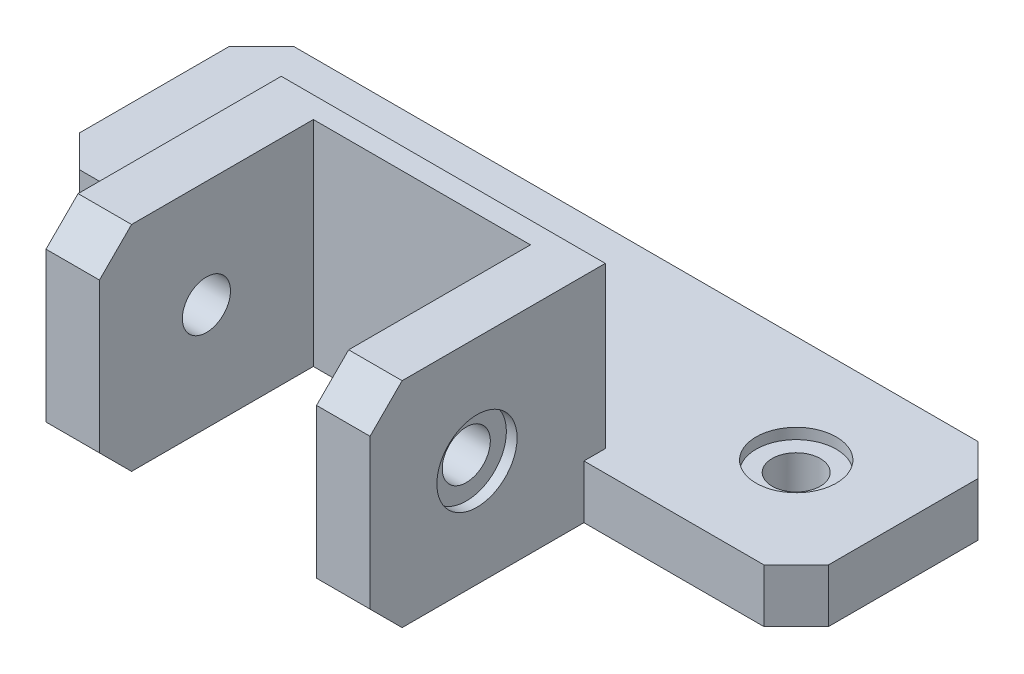
ISO-10303-21;
HEADER;
FILE_DESCRIPTION(('STEP AP214'),'2;1');
FILE_NAME('part.step','',(''),(''),'','','');
FILE_SCHEMA(('AUTOMOTIVE_DESIGN { 1 0 10303 214 1 1 1 1 }'));
ENDSEC;
DATA;
#1=APPLICATION_CONTEXT('core data for automotive mechanical design processes');
#2=APPLICATION_PROTOCOL_DEFINITION('international standard','automotive_design',2000,#1);
#3=PRODUCT_CONTEXT('',#1,'mechanical');
#4=PRODUCT('Part','Part','',(#3));
#5=PRODUCT_RELATED_PRODUCT_CATEGORY('part','',(#4));
#6=PRODUCT_DEFINITION_FORMATION('','',#4);
#7=PRODUCT_DEFINITION_CONTEXT('part definition',#1,'design');
#8=PRODUCT_DEFINITION('design','',#6,#7);
#9=PRODUCT_DEFINITION_SHAPE('','',#8);
#10=(LENGTH_UNIT() NAMED_UNIT(*) SI_UNIT(.MILLI.,.METRE.));
#11=(NAMED_UNIT(*) PLANE_ANGLE_UNIT() SI_UNIT($,.RADIAN.));
#12=(NAMED_UNIT(*) SI_UNIT($,.STERADIAN.) SOLID_ANGLE_UNIT());
#13=UNCERTAINTY_MEASURE_WITH_UNIT(LENGTH_MEASURE(1.E-05),#10,'distance_accuracy_value','');
#14=(GEOMETRIC_REPRESENTATION_CONTEXT(3) GLOBAL_UNCERTAINTY_ASSIGNED_CONTEXT((#13)) GLOBAL_UNIT_ASSIGNED_CONTEXT((#10,
#11,#12)) REPRESENTATION_CONTEXT('',''));
#15=CARTESIAN_POINT('',(0.,0.,0.));
#16=DIRECTION('',(0.,0.,1.));
#17=DIRECTION('',(1.,0.,0.));
#18=AXIS2_PLACEMENT_3D('',#15,#16,#17);
#19=CARTESIAN_POINT('',(35.,10.,20.));
#20=DIRECTION('',(-1.,0.,0.));
#21=DIRECTION('',(0.,0.,1.));
#22=AXIS2_PLACEMENT_3D('',#19,#20,#21);
#23=CYLINDRICAL_SURFACE('',#22,2.25);
#24=CARTESIAN_POINT('',(10.15,10.,20.));
#25=DIRECTION('',(1.,0.,0.));
#26=DIRECTION('',(0.,0.,-1.));
#27=AXIS2_PLACEMENT_3D('',#24,#25,#26);
#28=CIRCLE('',#27,2.25);
#29=CARTESIAN_POINT('',(10.15,10.,17.75));
#30=VERTEX_POINT('',#29);
#31=EDGE_CURVE('E301',#30,#30,#28,.T.);
#32=ORIENTED_EDGE('',*,*,#31,.F.);
#33=EDGE_LOOP('',(#32));
#34=FACE_BOUND('',#33,.T.);
#35=CARTESIAN_POINT('',(14.15,10.,20.));
#36=DIRECTION('',(1.,0.,0.));
#37=DIRECTION('',(0.,0.,-1.));
#38=AXIS2_PLACEMENT_3D('',#35,#36,#37);
#39=CIRCLE('',#38,2.25);
#40=CARTESIAN_POINT('',(14.15,10.,17.75));
#41=VERTEX_POINT('',#40);
#42=EDGE_CURVE('E309',#41,#41,#39,.F.);
#43=ORIENTED_EDGE('',*,*,#42,.F.);
#44=EDGE_LOOP('',(#43));
#45=FACE_BOUND('',#44,.T.);
#46=ADVANCED_FACE('F34',(#34,#45),#23,.F.);
#47=CARTESIAN_POINT('',(-10.15,10.,20.));
#48=DIRECTION('',(-1.,0.,0.));
#49=DIRECTION('',(0.,0.,1.));
#50=AXIS2_PLACEMENT_3D('',#47,#48,#49);
#51=CIRCLE('',#50,2.25);
#52=CARTESIAN_POINT('',(-10.15,10.,22.25));
#53=VERTEX_POINT('',#52);
#54=EDGE_CURVE('E304',#53,#53,#51,.T.);
#55=ORIENTED_EDGE('',*,*,#54,.F.);
#56=EDGE_LOOP('',(#55));
#57=FACE_BOUND('',#56,.T.);
#58=CARTESIAN_POINT('',(-14.15,10.,20.));
#59=DIRECTION('',(-1.,0.,0.));
#60=DIRECTION('',(0.,0.,1.));
#61=AXIS2_PLACEMENT_3D('',#58,#59,#60);
#62=CIRCLE('',#61,2.25);
#63=CARTESIAN_POINT('',(-14.15,10.,22.25));
#64=VERTEX_POINT('',#63);
#65=EDGE_CURVE('E305',#64,#64,#62,.F.);
#66=ORIENTED_EDGE('',*,*,#65,.F.);
#67=EDGE_LOOP('',(#66));
#68=FACE_BOUND('',#67,.T.);
#69=ADVANCED_FACE('F531',(#57,#68),#23,.F.);
#70=CARTESIAN_POINT('',(0.,-0.00100000000000013,0.));
#71=DIRECTION('',(0.,1.,0.));
#72=DIRECTION('',(0.,0.,1.));
#73=AXIS2_PLACEMENT_3D('',#70,#71,#72);
#74=CYLINDRICAL_SURFACE('',#73,2.25);
#75=CARTESIAN_POINT('',(0.,0.,0.));
#76=DIRECTION('',(0.,-1.,0.));
#77=DIRECTION('',(0.,0.,-1.));
#78=AXIS2_PLACEMENT_3D('',#75,#76,#77);
#79=CIRCLE('',#78,2.25);
#80=CARTESIAN_POINT('',(0.,0.,-2.25));
#81=VERTEX_POINT('',#80);
#82=EDGE_CURVE('E429',#81,#81,#79,.F.);
#83=ORIENTED_EDGE('',*,*,#82,.F.);
#84=EDGE_LOOP('',(#83));
#85=FACE_BOUND('',#84,.T.);
#86=CARTESIAN_POINT('',(0.,4.,0.));
#87=DIRECTION('',(0.,1.,0.));
#88=DIRECTION('',(0.,0.,1.));
#89=AXIS2_PLACEMENT_3D('',#86,#87,#88);
#90=CIRCLE('',#89,2.25);
#91=CARTESIAN_POINT('',(0.,4.,2.25));
#92=VERTEX_POINT('',#91);
#93=EDGE_CURVE('E288',#92,#92,#90,.F.);
#94=ORIENTED_EDGE('',*,*,#93,.F.);
#95=EDGE_LOOP('',(#94));
#96=FACE_BOUND('',#95,.T.);
#97=ADVANCED_FACE('F537',(#85,#96),#74,.F.);
#98=CARTESIAN_POINT('',(25.,-0.00100000000000013,0.));
#99=DIRECTION('',(0.,1.,0.));
#100=DIRECTION('',(0.,0.,1.));
#101=AXIS2_PLACEMENT_3D('',#98,#99,#100);
#102=CYLINDRICAL_SURFACE('',#101,2.25);
#103=CARTESIAN_POINT('',(25.,0.,0.));
#104=DIRECTION('',(0.,-1.,0.));
#105=DIRECTION('',(0.,0.,-1.));
#106=AXIS2_PLACEMENT_3D('',#103,#104,#105);
#107=CIRCLE('',#106,2.25);
#108=CARTESIAN_POINT('',(25.,0.,-2.25));
#109=VERTEX_POINT('',#108);
#110=EDGE_CURVE('E426',#109,#109,#107,.F.);
#111=ORIENTED_EDGE('',*,*,#110,.F.);
#112=EDGE_LOOP('',(#111));
#113=FACE_BOUND('',#112,.T.);
#114=CARTESIAN_POINT('',(25.,4.,0.));
#115=DIRECTION('',(0.,1.,0.));
#116=DIRECTION('',(0.,0.,1.));
#117=AXIS2_PLACEMENT_3D('',#114,#115,#116);
#118=CIRCLE('',#117,2.25);
#119=CARTESIAN_POINT('',(25.,4.,2.25));
#120=VERTEX_POINT('',#119);
#121=EDGE_CURVE('E284',#120,#120,#118,.F.);
#122=ORIENTED_EDGE('',*,*,#121,.F.);
#123=EDGE_LOOP('',(#122));
#124=FACE_BOUND('',#123,.T.);
#125=ADVANCED_FACE('F570',(#113,#124),#102,.F.);
#126=CARTESIAN_POINT('',(-25.,-0.00100000000000013,1.74574066942157E-13));
#127=DIRECTION('',(0.,1.,0.));
#128=DIRECTION('',(0.,0.,1.));
#129=AXIS2_PLACEMENT_3D('',#126,#127,#128);
#130=CYLINDRICAL_SURFACE('',#129,2.25);
#131=CARTESIAN_POINT('',(-25.,0.,1.74574066942157E-13));
#132=DIRECTION('',(0.,-1.,0.));
#133=DIRECTION('',(0.,0.,-1.));
#134=AXIS2_PLACEMENT_3D('',#131,#132,#133);
#135=CIRCLE('',#134,2.25);
#136=CARTESIAN_POINT('',(-25.,0.,-2.24999999999982));
#137=VERTEX_POINT('',#136);
#138=EDGE_CURVE('E300',#137,#137,#135,.F.);
#139=ORIENTED_EDGE('',*,*,#138,.F.);
#140=EDGE_LOOP('',(#139));
#141=FACE_BOUND('',#140,.T.);
#142=CARTESIAN_POINT('',(-25.,4.,1.74574066942157E-13));
#143=DIRECTION('',(0.,1.,0.));
#144=DIRECTION('',(0.,0.,1.));
#145=AXIS2_PLACEMENT_3D('',#142,#143,#144);
#146=CIRCLE('',#145,2.25);
#147=CARTESIAN_POINT('',(-25.,4.,2.25000000000017));
#148=VERTEX_POINT('',#147);
#149=EDGE_CURVE('E281',#148,#148,#146,.F.);
#150=ORIENTED_EDGE('',*,*,#149,.F.);
#151=EDGE_LOOP('',(#150));
#152=FACE_BOUND('',#151,.T.);
#153=ADVANCED_FACE('F573',(#141,#152),#130,.F.);
#154=CARTESIAN_POINT('',(-35.,5.,10.));
#155=DIRECTION('',(0.,0.,-1.));
#156=DIRECTION('',(-1.,0.,0.));
#157=AXIS2_PLACEMENT_3D('',#154,#155,#156);
#158=PLANE('',#157);
#159=DIRECTION('',(1.,0.,0.));
#160=VECTOR('',#159,1.);
#161=CARTESIAN_POINT('',(-35.,0.,10.));
#162=LINE('',#161,#160);
#163=CARTESIAN_POINT('',(15.15,0.,10.));
#164=VERTEX_POINT('',#163);
#165=CARTESIAN_POINT('',(32.,0.,10.));
#166=VERTEX_POINT('',#165);
#167=EDGE_CURVE('E278',#164,#166,#162,.T.);
#168=ORIENTED_EDGE('',*,*,#167,.T.);
#169=DIRECTION('',(0.,1.,0.));
#170=VECTOR('',#169,1.);
#171=CARTESIAN_POINT('',(32.,5.,10.));
#172=LINE('',#171,#170);
#173=CARTESIAN_POINT('',(32.,5.,10.));
#174=VERTEX_POINT('',#173);
#175=EDGE_CURVE('E376',#166,#174,#172,.T.);
#176=ORIENTED_EDGE('',*,*,#175,.T.);
#177=DIRECTION('',(1.,0.,0.));
#178=VECTOR('',#177,1.);
#179=CARTESIAN_POINT('',(-35.,5.,10.));
#180=LINE('',#179,#178);
#181=CARTESIAN_POINT('',(15.15,5.,10.));
#182=VERTEX_POINT('',#181);
#183=EDGE_CURVE('E266',#182,#174,#180,.T.);
#184=ORIENTED_EDGE('',*,*,#183,.F.);
#185=DIRECTION('',(0.,1.,0.));
#186=VECTOR('',#185,1.);
#187=CARTESIAN_POINT('',(15.15,5.,10.));
#188=LINE('',#187,#186);
#189=EDGE_CURVE('E252',#164,#182,#188,.T.);
#190=ORIENTED_EDGE('',*,*,#189,.F.);
#191=EDGE_LOOP('',(#168,#176,#184,#190));
#192=FACE_BOUND('',#191,.T.);
#193=ADVANCED_FACE('F466',(#192),#158,.F.);
#194=CARTESIAN_POINT('',(-32.,5.,10.));
#195=VERTEX_POINT('',#194);
#196=CARTESIAN_POINT('',(-15.15,5.,10.));
#197=VERTEX_POINT('',#196);
#198=EDGE_CURVE('E267',#195,#197,#180,.T.);
#199=ORIENTED_EDGE('',*,*,#198,.F.);
#200=DIRECTION('',(0.,-1.,0.));
#201=VECTOR('',#200,1.);
#202=CARTESIAN_POINT('',(-32.,5.,10.));
#203=LINE('',#202,#201);
#204=CARTESIAN_POINT('',(-32.,0.,10.));
#205=VERTEX_POINT('',#204);
#206=EDGE_CURVE('E338',#195,#205,#203,.T.);
#207=ORIENTED_EDGE('',*,*,#206,.T.);
#208=CARTESIAN_POINT('',(-15.15,0.,10.));
#209=VERTEX_POINT('',#208);
#210=EDGE_CURVE('E260',#205,#209,#162,.T.);
#211=ORIENTED_EDGE('',*,*,#210,.T.);
#212=DIRECTION('',(0.,-1.,0.));
#213=VECTOR('',#212,1.);
#214=CARTESIAN_POINT('',(-15.15,5.,10.));
#215=LINE('',#214,#213);
#216=EDGE_CURVE('E243',#197,#209,#215,.T.);
#217=ORIENTED_EDGE('',*,*,#216,.F.);
#218=EDGE_LOOP('',(#199,#207,#211,#217));
#219=FACE_BOUND('',#218,.T.);
#220=ADVANCED_FACE('F507',(#219),#158,.F.);
#221=DIRECTION('',(0.,-1.,0.));
#222=VECTOR('',#221,1.);
#223=CARTESIAN_POINT('',(-10.15,20.,9.99999999999999));
#224=LINE('',#223,#222);
#225=CARTESIAN_POINT('',(-10.15,20.,9.99999999999999));
#226=VERTEX_POINT('',#225);
#227=CARTESIAN_POINT('',(-10.15,0.,10.));
#228=VERTEX_POINT('',#227);
#229=EDGE_CURVE('E212',#226,#228,#224,.T.);
#230=ORIENTED_EDGE('',*,*,#229,.T.);
#231=CARTESIAN_POINT('',(10.15,0.,10.));
#232=VERTEX_POINT('',#231);
#233=EDGE_CURVE('E280',#228,#232,#162,.T.);
#234=ORIENTED_EDGE('',*,*,#233,.T.);
#235=DIRECTION('',(0.,-1.,0.));
#236=VECTOR('',#235,1.);
#237=CARTESIAN_POINT('',(10.15,20.,9.99999999999999));
#238=LINE('',#237,#236);
#239=CARTESIAN_POINT('',(10.15,20.,9.99999999999999));
#240=VERTEX_POINT('',#239);
#241=EDGE_CURVE('E220',#240,#232,#238,.T.);
#242=ORIENTED_EDGE('',*,*,#241,.F.);
#243=DIRECTION('',(1.,0.,0.));
#244=VECTOR('',#243,1.);
#245=CARTESIAN_POINT('',(10.15,20.,9.99999999999999));
#246=LINE('',#245,#244);
#247=EDGE_CURVE('E204',#226,#240,#246,.T.);
#248=ORIENTED_EDGE('',*,*,#247,.F.);
#249=EDGE_LOOP('',(#230,#234,#242,#248));
#250=FACE_BOUND('',#249,.T.);
#251=ADVANCED_FACE('F222',(#250),#158,.F.);
#252=CARTESIAN_POINT('',(0.,5.,0.));
#253=DIRECTION('',(0.,-1.,0.));
#254=DIRECTION('',(0.,0.,-1.));
#255=AXIS2_PLACEMENT_3D('',#252,#253,#254);
#256=PLANE('',#255);
#257=CARTESIAN_POINT('',(-25.,5.,1.74574066942157E-13));
#258=DIRECTION('',(0.,-1.,0.));
#259=DIRECTION('',(0.,0.,-1.));
#260=AXIS2_PLACEMENT_3D('',#257,#258,#259);
#261=CIRCLE('',#260,3.75);
#262=CARTESIAN_POINT('',(-25.,5.,-3.74999999999983));
#263=VERTEX_POINT('',#262);
#264=EDGE_CURVE('E297',#263,#263,#261,.F.);
#265=ORIENTED_EDGE('',*,*,#264,.F.);
#266=EDGE_LOOP('',(#265));
#267=FACE_BOUND('',#266,.T.);
#268=CARTESIAN_POINT('',(0.,5.,1.74574066942157E-13));
#269=DIRECTION('',(0.,-1.,0.));
#270=DIRECTION('',(0.,0.,-1.));
#271=AXIS2_PLACEMENT_3D('',#268,#269,#270);
#272=CIRCLE('',#271,3.75);
#273=CARTESIAN_POINT('',(0.,5.,-3.74999999999983));
#274=VERTEX_POINT('',#273);
#275=EDGE_CURVE('E294',#274,#274,#272,.F.);
#276=ORIENTED_EDGE('',*,*,#275,.F.);
#277=EDGE_LOOP('',(#276));
#278=FACE_BOUND('',#277,.T.);
#279=CARTESIAN_POINT('',(25.,5.,1.74574066942157E-13));
#280=DIRECTION('',(0.,-1.,0.));
#281=DIRECTION('',(0.,0.,-1.));
#282=AXIS2_PLACEMENT_3D('',#279,#280,#281);
#283=CIRCLE('',#282,3.75);
#284=CARTESIAN_POINT('',(25.,5.,-3.74999999999983));
#285=VERTEX_POINT('',#284);
#286=EDGE_CURVE('E291',#285,#285,#283,.F.);
#287=ORIENTED_EDGE('',*,*,#286,.F.);
#288=EDGE_LOOP('',(#287));
#289=FACE_BOUND('',#288,.T.);
#290=DIRECTION('',(0.,0.,1.));
#291=VECTOR('',#290,1.);
#292=CARTESIAN_POINT('',(-35.,5.,10.));
#293=LINE('',#292,#291);
#294=CARTESIAN_POINT('',(-35.,5.,-7.));
#295=VERTEX_POINT('',#294);
#296=CARTESIAN_POINT('',(-35.,5.,6.99999999999999));
#297=VERTEX_POINT('',#296);
#298=EDGE_CURVE('E263',#295,#297,#293,.T.);
#299=ORIENTED_EDGE('',*,*,#298,.T.);
#300=DIRECTION('',(-0.707106781186546,0.,-0.707106781186549));
#301=VECTOR('',#300,1.);
#302=CARTESIAN_POINT('',(-32.,5.,10.));
#303=LINE('',#302,#301);
#304=EDGE_CURVE('E364',#297,#195,#303,.F.);
#305=ORIENTED_EDGE('',*,*,#304,.T.);
#306=ORIENTED_EDGE('',*,*,#198,.T.);
#307=DIRECTION('',(0.,0.,1.));
#308=VECTOR('',#307,1.);
#309=CARTESIAN_POINT('',(-15.15,5.,0.));
#310=LINE('',#309,#308);
#311=CARTESIAN_POINT('',(-15.15,5.,7.99999999999998));
#312=VERTEX_POINT('',#311);
#313=EDGE_CURVE('E240',#312,#197,#310,.T.);
#314=ORIENTED_EDGE('',*,*,#313,.F.);
#315=DIRECTION('',(-0.707106781186549,0.,0.707106781186546));
#316=VECTOR('',#315,1.);
#317=CARTESIAN_POINT('',(-3.57499999999997,5.,-3.57499999999999));
#318=LINE('',#317,#316);
#319=CARTESIAN_POINT('',(-12.15,5.,5.));
#320=VERTEX_POINT('',#319);
#321=EDGE_CURVE('E11',#312,#320,#318,.F.);
#322=ORIENTED_EDGE('',*,*,#321,.T.);
#323=DIRECTION('',(-1.,0.,0.));
#324=VECTOR('',#323,1.);
#325=CARTESIAN_POINT('',(0.,5.,5.));
#326=LINE('',#325,#324);
#327=CARTESIAN_POINT('',(12.15,5.,5.));
#328=VERTEX_POINT('',#327);
#329=EDGE_CURVE('E246',#328,#320,#326,.T.);
#330=ORIENTED_EDGE('',*,*,#329,.F.);
#331=DIRECTION('',(-0.707106781186549,0.,-0.707106781186546));
#332=VECTOR('',#331,1.);
#333=CARTESIAN_POINT('',(3.57499999999997,5.,-3.57499999999999));
#334=LINE('',#333,#332);
#335=CARTESIAN_POINT('',(15.15,5.,7.99999999999998));
#336=VERTEX_POINT('',#335);
#337=EDGE_CURVE('E44',#328,#336,#334,.F.);
#338=ORIENTED_EDGE('',*,*,#337,.T.);
#339=DIRECTION('',(0.,0.,-1.));
#340=VECTOR('',#339,1.);
#341=CARTESIAN_POINT('',(15.15,5.,0.));
#342=LINE('',#341,#340);
#343=EDGE_CURVE('E249',#182,#336,#342,.T.);
#344=ORIENTED_EDGE('',*,*,#343,.F.);
#345=ORIENTED_EDGE('',*,*,#183,.T.);
#346=DIRECTION('',(-0.707106781186549,0.,0.707106781186546));
#347=VECTOR('',#346,1.);
#348=CARTESIAN_POINT('',(35.,5.,7.));
#349=LINE('',#348,#347);
#350=CARTESIAN_POINT('',(35.,5.,7.));
#351=VERTEX_POINT('',#350);
#352=EDGE_CURVE('E358',#174,#351,#349,.F.);
#353=ORIENTED_EDGE('',*,*,#352,.T.);
#354=DIRECTION('',(0.,0.,-1.));
#355=VECTOR('',#354,1.);
#356=CARTESIAN_POINT('',(35.,5.,10.));
#357=LINE('',#356,#355);
#358=CARTESIAN_POINT('',(35.,5.,-6.99999999999998));
#359=VERTEX_POINT('',#358);
#360=EDGE_CURVE('E256',#351,#359,#357,.T.);
#361=ORIENTED_EDGE('',*,*,#360,.T.);
#362=DIRECTION('',(0.707106781186546,0.,0.707106781186549));
#363=VECTOR('',#362,1.);
#364=CARTESIAN_POINT('',(32.,5.,-10.));
#365=LINE('',#364,#363);
#366=CARTESIAN_POINT('',(32.,5.,-10.));
#367=VERTEX_POINT('',#366);
#368=EDGE_CURVE('E360',#359,#367,#365,.F.);
#369=ORIENTED_EDGE('',*,*,#368,.T.);
#370=DIRECTION('',(-1.,0.,0.));
#371=VECTOR('',#370,1.);
#372=CARTESIAN_POINT('',(-35.,5.,-10.));
#373=LINE('',#372,#371);
#374=CARTESIAN_POINT('',(-32.,5.,-10.));
#375=VERTEX_POINT('',#374);
#376=EDGE_CURVE('E259',#367,#375,#373,.T.);
#377=ORIENTED_EDGE('',*,*,#376,.T.);
#378=DIRECTION('',(0.707106781186549,0.,-0.707106781186546));
#379=VECTOR('',#378,1.);
#380=CARTESIAN_POINT('',(-35.,5.,-7.));
#381=LINE('',#380,#379);
#382=EDGE_CURVE('E362',#375,#295,#381,.F.);
#383=ORIENTED_EDGE('',*,*,#382,.T.);
#384=EDGE_LOOP('',(#299,#305,#306,#314,#322,#330,#338,#344,#345,#353,#361,#369,#377,#383));
#385=FACE_BOUND('',#384,.T.);
#386=ADVANCED_FACE('F476',(#267,#278,#289,#385),#256,.F.);
#387=CARTESIAN_POINT('',(35.,5.,10.));
#388=DIRECTION('',(-1.,0.,0.));
#389=DIRECTION('',(0.,0.,1.));
#390=AXIS2_PLACEMENT_3D('',#387,#388,#389);
#391=PLANE('',#390);
#392=DIRECTION('',(0.,0.,-1.));
#393=VECTOR('',#392,1.);
#394=CARTESIAN_POINT('',(35.,0.,10.));
#395=LINE('',#394,#393);
#396=CARTESIAN_POINT('',(35.,0.,7.));
#397=VERTEX_POINT('',#396);
#398=CARTESIAN_POINT('',(35.,0.,-6.99999999999998));
#399=VERTEX_POINT('',#398);
#400=EDGE_CURVE('E255',#397,#399,#395,.T.);
#401=ORIENTED_EDGE('',*,*,#400,.T.);
#402=DIRECTION('',(0.,1.,0.));
#403=VECTOR('',#402,1.);
#404=CARTESIAN_POINT('',(35.,5.,-6.99999999999998));
#405=LINE('',#404,#403);
#406=EDGE_CURVE('E374',#399,#359,#405,.T.);
#407=ORIENTED_EDGE('',*,*,#406,.T.);
#408=ORIENTED_EDGE('',*,*,#360,.F.);
#409=DIRECTION('',(0.,-1.,0.));
#410=VECTOR('',#409,1.);
#411=CARTESIAN_POINT('',(35.,5.,7.));
#412=LINE('',#411,#410);
#413=EDGE_CURVE('E371',#351,#397,#412,.T.);
#414=ORIENTED_EDGE('',*,*,#413,.T.);
#415=EDGE_LOOP('',(#401,#407,#408,#414));
#416=FACE_BOUND('',#415,.T.);
#417=ADVANCED_FACE('F479',(#416),#391,.F.);
#418=CARTESIAN_POINT('',(-35.,5.,-10.));
#419=DIRECTION('',(0.,0.,1.));
#420=DIRECTION('',(1.,0.,0.));
#421=AXIS2_PLACEMENT_3D('',#418,#419,#420);
#422=PLANE('',#421);
#423=DIRECTION('',(-1.,0.,0.));
#424=VECTOR('',#423,1.);
#425=CARTESIAN_POINT('',(-35.,0.,-10.));
#426=LINE('',#425,#424);
#427=CARTESIAN_POINT('',(32.,0.,-10.));
#428=VERTEX_POINT('',#427);
#429=CARTESIAN_POINT('',(-32.,0.,-10.));
#430=VERTEX_POINT('',#429);
#431=EDGE_CURVE('E272',#428,#430,#426,.T.);
#432=ORIENTED_EDGE('',*,*,#431,.T.);
#433=DIRECTION('',(0.,1.,0.));
#434=VECTOR('',#433,1.);
#435=CARTESIAN_POINT('',(-32.,5.,-10.));
#436=LINE('',#435,#434);
#437=EDGE_CURVE('E369',#430,#375,#436,.T.);
#438=ORIENTED_EDGE('',*,*,#437,.T.);
#439=ORIENTED_EDGE('',*,*,#376,.F.);
#440=DIRECTION('',(0.,-1.,0.));
#441=VECTOR('',#440,1.);
#442=CARTESIAN_POINT('',(32.,5.,-10.));
#443=LINE('',#442,#441);
#444=EDGE_CURVE('E366',#367,#428,#443,.T.);
#445=ORIENTED_EDGE('',*,*,#444,.T.);
#446=EDGE_LOOP('',(#432,#438,#439,#445));
#447=FACE_BOUND('',#446,.T.);
#448=ADVANCED_FACE('F488',(#447),#422,.F.);
#449=CARTESIAN_POINT('',(-35.,5.,10.));
#450=DIRECTION('',(1.,0.,0.));
#451=DIRECTION('',(0.,0.,-1.));
#452=AXIS2_PLACEMENT_3D('',#449,#450,#451);
#453=PLANE('',#452);
#454=DIRECTION('',(0.,0.,1.));
#455=VECTOR('',#454,1.);
#456=CARTESIAN_POINT('',(-35.,0.,10.));
#457=LINE('',#456,#455);
#458=CARTESIAN_POINT('',(-35.,0.,-7.));
#459=VERTEX_POINT('',#458);
#460=CARTESIAN_POINT('',(-35.,0.,6.99999999999999));
#461=VERTEX_POINT('',#460);
#462=EDGE_CURVE('E275',#459,#461,#457,.T.);
#463=ORIENTED_EDGE('',*,*,#462,.T.);
#464=DIRECTION('',(0.,1.,0.));
#465=VECTOR('',#464,1.);
#466=CARTESIAN_POINT('',(-35.,5.,6.99999999999999));
#467=LINE('',#466,#465);
#468=EDGE_CURVE('E356',#461,#297,#467,.T.);
#469=ORIENTED_EDGE('',*,*,#468,.T.);
#470=ORIENTED_EDGE('',*,*,#298,.F.);
#471=DIRECTION('',(0.,-1.,0.));
#472=VECTOR('',#471,1.);
#473=CARTESIAN_POINT('',(-35.,5.,-7.));
#474=LINE('',#473,#472);
#475=EDGE_CURVE('E353',#295,#459,#474,.T.);
#476=ORIENTED_EDGE('',*,*,#475,.T.);
#477=EDGE_LOOP('',(#463,#469,#470,#476));
#478=FACE_BOUND('',#477,.T.);
#479=ADVANCED_FACE('F497',(#478),#453,.F.);
#480=CARTESIAN_POINT('',(0.,0.,0.));
#481=DIRECTION('',(0.,-1.,0.));
#482=DIRECTION('',(0.,0.,-1.));
#483=AXIS2_PLACEMENT_3D('',#480,#481,#482);
#484=PLANE('',#483);
#485=ORIENTED_EDGE('',*,*,#138,.T.);
#486=EDGE_LOOP('',(#485));
#487=FACE_BOUND('',#486,.T.);
#488=ORIENTED_EDGE('',*,*,#110,.T.);
#489=EDGE_LOOP('',(#488));
#490=FACE_BOUND('',#489,.T.);
#491=ORIENTED_EDGE('',*,*,#82,.T.);
#492=EDGE_LOOP('',(#491));
#493=FACE_BOUND('',#492,.T.);
#494=ORIENTED_EDGE('',*,*,#210,.F.);
#495=DIRECTION('',(0.707106781186546,0.,0.707106781186549));
#496=VECTOR('',#495,1.);
#497=CARTESIAN_POINT('',(-21.0000000000001,0.,21.));
#498=LINE('',#497,#496);
#499=EDGE_CURVE('E351',#205,#461,#498,.F.);
#500=ORIENTED_EDGE('',*,*,#499,.T.);
#501=ORIENTED_EDGE('',*,*,#462,.F.);
#502=DIRECTION('',(-0.707106781186549,0.,0.707106781186546));
#503=VECTOR('',#502,1.);
#504=CARTESIAN_POINT('',(-20.9999999999999,0.,-21.));
#505=LINE('',#504,#503);
#506=EDGE_CURVE('E349',#459,#430,#505,.F.);
#507=ORIENTED_EDGE('',*,*,#506,.T.);
#508=ORIENTED_EDGE('',*,*,#431,.F.);
#509=DIRECTION('',(-0.707106781186546,0.,-0.707106781186549));
#510=VECTOR('',#509,1.);
#511=CARTESIAN_POINT('',(21.0000000000001,0.,-21.));
#512=LINE('',#511,#510);
#513=EDGE_CURVE('E347',#428,#399,#512,.F.);
#514=ORIENTED_EDGE('',*,*,#513,.T.);
#515=ORIENTED_EDGE('',*,*,#400,.F.);
#516=DIRECTION('',(0.707106781186549,0.,-0.707106781186546));
#517=VECTOR('',#516,1.);
#518=CARTESIAN_POINT('',(20.9999999999999,0.,21.));
#519=LINE('',#518,#517);
#520=EDGE_CURVE('E345',#397,#166,#519,.F.);
#521=ORIENTED_EDGE('',*,*,#520,.T.);
#522=ORIENTED_EDGE('',*,*,#167,.F.);
#523=DIRECTION('',(0.,0.,-1.));
#524=VECTOR('',#523,1.);
#525=CARTESIAN_POINT('',(15.15,0.,5.));
#526=LINE('',#525,#524);
#527=CARTESIAN_POINT('',(15.15,0.,27.));
#528=VERTEX_POINT('',#527);
#529=EDGE_CURVE('E434',#528,#164,#526,.T.);
#530=ORIENTED_EDGE('',*,*,#529,.F.);
#531=DIRECTION('',(-1.,0.,0.));
#532=VECTOR('',#531,1.);
#533=CARTESIAN_POINT('',(10.15,0.,27.));
#534=LINE('',#533,#532);
#535=CARTESIAN_POINT('',(10.15,0.,27.));
#536=VERTEX_POINT('',#535);
#537=EDGE_CURVE('E343',#528,#536,#534,.T.);
#538=ORIENTED_EDGE('',*,*,#537,.T.);
#539=DIRECTION('',(0.,0.,1.));
#540=VECTOR('',#539,1.);
#541=CARTESIAN_POINT('',(10.15,0.,9.99999999999999));
#542=LINE('',#541,#540);
#543=EDGE_CURVE('E440',#232,#536,#542,.T.);
#544=ORIENTED_EDGE('',*,*,#543,.F.);
#545=ORIENTED_EDGE('',*,*,#233,.F.);
#546=DIRECTION('',(0.,0.,-1.));
#547=VECTOR('',#546,1.);
#548=CARTESIAN_POINT('',(-10.15,0.,9.99999999999999));
#549=LINE('',#548,#547);
#550=CARTESIAN_POINT('',(-10.15,0.,27.));
#551=VERTEX_POINT('',#550);
#552=EDGE_CURVE('E215',#551,#228,#549,.T.);
#553=ORIENTED_EDGE('',*,*,#552,.F.);
#554=DIRECTION('',(-1.,0.,0.));
#555=VECTOR('',#554,1.);
#556=CARTESIAN_POINT('',(-15.15,0.,27.));
#557=LINE('',#556,#555);
#558=CARTESIAN_POINT('',(-15.15,0.,27.));
#559=VERTEX_POINT('',#558);
#560=EDGE_CURVE('E341',#551,#559,#557,.T.);
#561=ORIENTED_EDGE('',*,*,#560,.T.);
#562=DIRECTION('',(0.,0.,1.));
#563=VECTOR('',#562,1.);
#564=CARTESIAN_POINT('',(-15.15,0.,5.));
#565=LINE('',#564,#563);
#566=EDGE_CURVE('E436',#209,#559,#565,.T.);
#567=ORIENTED_EDGE('',*,*,#566,.F.);
#568=EDGE_LOOP('',(#494,#500,#501,#507,#508,#514,#515,#521,#522,#530,#538,#544,#545,#553,#561,#567));
#569=FACE_BOUND('',#568,.T.);
#570=ADVANCED_FACE('F459',(#487,#490,#493,#569),#484,.T.);
#571=CARTESIAN_POINT('',(15.15,20.,5.));
#572=DIRECTION('',(-1.,0.,0.));
#573=DIRECTION('',(0.,0.,1.));
#574=AXIS2_PLACEMENT_3D('',#571,#572,#573);
#575=PLANE('',#574);
#576=CARTESIAN_POINT('',(15.15,10.,20.));
#577=DIRECTION('',(1.,0.,0.));
#578=DIRECTION('',(0.,0.,-1.));
#579=AXIS2_PLACEMENT_3D('',#576,#577,#578);
#580=CIRCLE('',#579,3.75);
#581=CARTESIAN_POINT('',(15.15,10.,16.25));
#582=VERTEX_POINT('',#581);
#583=EDGE_CURVE('E400',#582,#582,#580,.T.);
#584=ORIENTED_EDGE('',*,*,#583,.F.);
#585=EDGE_LOOP('',(#584));
#586=FACE_BOUND('',#585,.T.);
#587=ORIENTED_EDGE('',*,*,#343,.T.);
#588=DIRECTION('',(0.,1.,0.));
#589=VECTOR('',#588,1.);
#590=CARTESIAN_POINT('',(15.15,20.,7.99999999999998));
#591=LINE('',#590,#589);
#592=CARTESIAN_POINT('',(15.15,20.,7.99999999999998));
#593=VERTEX_POINT('',#592);
#594=EDGE_CURVE('E324',#336,#593,#591,.T.);
#595=ORIENTED_EDGE('',*,*,#594,.T.);
#596=DIRECTION('',(0.,0.,-1.));
#597=VECTOR('',#596,1.);
#598=CARTESIAN_POINT('',(15.15,20.,5.));
#599=LINE('',#598,#597);
#600=CARTESIAN_POINT('',(15.15,20.,27.));
#601=VERTEX_POINT('',#600);
#602=EDGE_CURVE('E443',#601,#593,#599,.T.);
#603=ORIENTED_EDGE('',*,*,#602,.F.);
#604=DIRECTION('',(0.,-0.707106781186549,0.707106781186546));
#605=VECTOR('',#604,1.);
#606=CARTESIAN_POINT('',(15.15,20.,27.));
#607=LINE('',#606,#605);
#608=CARTESIAN_POINT('',(15.15,17.,30.));
#609=VERTEX_POINT('',#608);
#610=EDGE_CURVE('E320',#601,#609,#607,.T.);
#611=ORIENTED_EDGE('',*,*,#610,.T.);
#612=DIRECTION('',(0.,-1.,0.));
#613=VECTOR('',#612,1.);
#614=CARTESIAN_POINT('',(15.15,20.,30.));
#615=LINE('',#614,#613);
#616=CARTESIAN_POINT('',(15.15,3.,30.));
#617=VERTEX_POINT('',#616);
#618=EDGE_CURVE('E226',#609,#617,#615,.T.);
#619=ORIENTED_EDGE('',*,*,#618,.T.);
#620=DIRECTION('',(0.,-0.707106781186546,-0.707106781186549));
#621=VECTOR('',#620,1.);
#622=CARTESIAN_POINT('',(15.15,3.,30.));
#623=LINE('',#622,#621);
#624=EDGE_CURVE('E322',#617,#528,#623,.T.);
#625=ORIENTED_EDGE('',*,*,#624,.T.);
#626=ORIENTED_EDGE('',*,*,#529,.T.);
#627=ORIENTED_EDGE('',*,*,#189,.T.);
#628=EDGE_LOOP('',(#587,#595,#603,#611,#619,#625,#626,#627));
#629=FACE_BOUND('',#628,.T.);
#630=ADVANCED_FACE('F516',(#586,#629),#575,.F.);
#631=CARTESIAN_POINT('',(-15.15,20.,5.));
#632=DIRECTION('',(0.,0.,1.));
#633=DIRECTION('',(1.,0.,0.));
#634=AXIS2_PLACEMENT_3D('',#631,#632,#633);
#635=PLANE('',#634);
#636=DIRECTION('',(1.,0.,0.));
#637=VECTOR('',#636,1.);
#638=CARTESIAN_POINT('',(15.15,17.,5.));
#639=LINE('',#638,#637);
#640=CARTESIAN_POINT('',(-12.15,17.,5.));
#641=VERTEX_POINT('',#640);
#642=CARTESIAN_POINT('',(12.15,17.,5.));
#643=VERTEX_POINT('',#642);
#644=EDGE_CURVE('E315',#641,#643,#639,.T.);
#645=ORIENTED_EDGE('',*,*,#644,.T.);
#646=DIRECTION('',(0.,-1.,0.));
#647=VECTOR('',#646,1.);
#648=CARTESIAN_POINT('',(12.15,20.,5.));
#649=LINE('',#648,#647);
#650=EDGE_CURVE('E317',#643,#328,#649,.T.);
#651=ORIENTED_EDGE('',*,*,#650,.T.);
#652=ORIENTED_EDGE('',*,*,#329,.T.);
#653=DIRECTION('',(0.,1.,0.));
#654=VECTOR('',#653,1.);
#655=CARTESIAN_POINT('',(-12.15,20.,5.));
#656=LINE('',#655,#654);
#657=EDGE_CURVE('E269',#320,#641,#656,.T.);
#658=ORIENTED_EDGE('',*,*,#657,.T.);
#659=EDGE_LOOP('',(#645,#651,#652,#658));
#660=FACE_BOUND('',#659,.T.);
#661=ADVANCED_FACE('F514',(#660),#635,.F.);
#662=CARTESIAN_POINT('',(-15.15,20.,5.));
#663=DIRECTION('',(1.,0.,0.));
#664=DIRECTION('',(0.,0.,-1.));
#665=AXIS2_PLACEMENT_3D('',#662,#663,#664);
#666=PLANE('',#665);
#667=CARTESIAN_POINT('',(-15.15,10.,20.));
#668=DIRECTION('',(-1.,0.,0.));
#669=DIRECTION('',(0.,0.,1.));
#670=AXIS2_PLACEMENT_3D('',#667,#668,#669);
#671=CIRCLE('',#670,3.75);
#672=CARTESIAN_POINT('',(-15.15,10.,23.75));
#673=VERTEX_POINT('',#672);
#674=EDGE_CURVE('E312',#673,#673,#671,.T.);
#675=ORIENTED_EDGE('',*,*,#674,.F.);
#676=EDGE_LOOP('',(#675));
#677=FACE_BOUND('',#676,.T.);
#678=DIRECTION('',(0.,0.,1.));
#679=VECTOR('',#678,1.);
#680=CARTESIAN_POINT('',(-15.15,20.,5.));
#681=LINE('',#680,#679);
#682=CARTESIAN_POINT('',(-15.15,20.,7.99999999999998));
#683=VERTEX_POINT('',#682);
#684=CARTESIAN_POINT('',(-15.15,20.,27.));
#685=VERTEX_POINT('',#684);
#686=EDGE_CURVE('E209',#683,#685,#681,.T.);
#687=ORIENTED_EDGE('',*,*,#686,.F.);
#688=DIRECTION('',(0.,-1.,0.));
#689=VECTOR('',#688,1.);
#690=CARTESIAN_POINT('',(-15.15,20.,7.99999999999998));
#691=LINE('',#690,#689);
#692=EDGE_CURVE('E336',#683,#312,#691,.T.);
#693=ORIENTED_EDGE('',*,*,#692,.T.);
#694=ORIENTED_EDGE('',*,*,#313,.T.);
#695=ORIENTED_EDGE('',*,*,#216,.T.);
#696=ORIENTED_EDGE('',*,*,#566,.T.);
#697=DIRECTION('',(0.,0.707106781186545,0.70710678118655));
#698=VECTOR('',#697,1.);
#699=CARTESIAN_POINT('',(-15.15,3.,30.));
#700=LINE('',#699,#698);
#701=CARTESIAN_POINT('',(-15.15,3.,30.));
#702=VERTEX_POINT('',#701);
#703=EDGE_CURVE('E334',#559,#702,#700,.T.);
#704=ORIENTED_EDGE('',*,*,#703,.T.);
#705=DIRECTION('',(0.,-1.,0.));
#706=VECTOR('',#705,1.);
#707=CARTESIAN_POINT('',(-15.15,20.,30.));
#708=LINE('',#707,#706);
#709=CARTESIAN_POINT('',(-15.15,17.,30.));
#710=VERTEX_POINT('',#709);
#711=EDGE_CURVE('E237',#710,#702,#708,.T.);
#712=ORIENTED_EDGE('',*,*,#711,.F.);
#713=DIRECTION('',(0.,0.707106781186549,-0.707106781186546));
#714=VECTOR('',#713,1.);
#715=CARTESIAN_POINT('',(-15.15,20.,27.));
#716=LINE('',#715,#714);
#717=EDGE_CURVE('E332',#710,#685,#716,.T.);
#718=ORIENTED_EDGE('',*,*,#717,.T.);
#719=EDGE_LOOP('',(#687,#693,#694,#695,#696,#704,#712,#718));
#720=FACE_BOUND('',#719,.T.);
#721=ADVANCED_FACE('F453',(#677,#720),#666,.F.);
#722=CARTESIAN_POINT('',(-10.15,20.,30.));
#723=DIRECTION('',(0.,0.,-1.));
#724=DIRECTION('',(-1.,0.,0.));
#725=AXIS2_PLACEMENT_3D('',#722,#723,#724);
#726=PLANE('',#725);
#727=ORIENTED_EDGE('',*,*,#711,.T.);
#728=DIRECTION('',(1.,0.,0.));
#729=VECTOR('',#728,1.);
#730=CARTESIAN_POINT('',(-10.15,3.,30.));
#731=LINE('',#730,#729);
#732=CARTESIAN_POINT('',(-10.15,3.,30.));
#733=VERTEX_POINT('',#732);
#734=EDGE_CURVE('E389',#702,#733,#731,.T.);
#735=ORIENTED_EDGE('',*,*,#734,.T.);
#736=DIRECTION('',(0.,-1.,0.));
#737=VECTOR('',#736,1.);
#738=CARTESIAN_POINT('',(-10.15,20.,30.));
#739=LINE('',#738,#737);
#740=CARTESIAN_POINT('',(-10.15,17.,30.));
#741=VERTEX_POINT('',#740);
#742=EDGE_CURVE('E219',#741,#733,#739,.T.);
#743=ORIENTED_EDGE('',*,*,#742,.F.);
#744=DIRECTION('',(-1.,0.,0.));
#745=VECTOR('',#744,1.);
#746=CARTESIAN_POINT('',(-15.15,17.,30.));
#747=LINE('',#746,#745);
#748=EDGE_CURVE('E387',#741,#710,#747,.T.);
#749=ORIENTED_EDGE('',*,*,#748,.T.);
#750=EDGE_LOOP('',(#727,#735,#743,#749));
#751=FACE_BOUND('',#750,.T.);
#752=ADVANCED_FACE('F452',(#751),#726,.F.);
#753=CARTESIAN_POINT('',(-10.15,20.,9.99999999999999));
#754=DIRECTION('',(-1.,0.,0.));
#755=DIRECTION('',(0.,0.,1.));
#756=AXIS2_PLACEMENT_3D('',#753,#754,#755);
#757=PLANE('',#756);
#758=ORIENTED_EDGE('',*,*,#54,.T.);
#759=EDGE_LOOP('',(#758));
#760=FACE_BOUND('',#759,.T.);
#761=ORIENTED_EDGE('',*,*,#742,.T.);
#762=DIRECTION('',(0.,-0.707106781186545,-0.70710678118655));
#763=VECTOR('',#762,1.);
#764=CARTESIAN_POINT('',(-10.15,3.,30.));
#765=LINE('',#764,#763);
#766=EDGE_CURVE('E52',#733,#551,#765,.T.);
#767=ORIENTED_EDGE('',*,*,#766,.T.);
#768=ORIENTED_EDGE('',*,*,#552,.T.);
#769=ORIENTED_EDGE('',*,*,#229,.F.);
#770=DIRECTION('',(0.,0.,-1.));
#771=VECTOR('',#770,1.);
#772=CARTESIAN_POINT('',(-10.15,20.,9.99999999999999));
#773=LINE('',#772,#771);
#774=CARTESIAN_POINT('',(-10.15,20.,27.));
#775=VERTEX_POINT('',#774);
#776=EDGE_CURVE('E198',#775,#226,#773,.T.);
#777=ORIENTED_EDGE('',*,*,#776,.F.);
#778=DIRECTION('',(0.,-0.707106781186549,0.707106781186546));
#779=VECTOR('',#778,1.);
#780=CARTESIAN_POINT('',(-10.15,20.,27.));
#781=LINE('',#780,#779);
#782=EDGE_CURVE('E60',#775,#741,#781,.T.);
#783=ORIENTED_EDGE('',*,*,#782,.T.);
#784=EDGE_LOOP('',(#761,#767,#768,#769,#777,#783));
#785=FACE_BOUND('',#784,.T.);
#786=ADVANCED_FACE('F213',(#760,#785),#757,.F.);
#787=CARTESIAN_POINT('',(10.15,20.,9.99999999999999));
#788=DIRECTION('',(1.,0.,0.));
#789=DIRECTION('',(0.,0.,-1.));
#790=AXIS2_PLACEMENT_3D('',#787,#788,#789);
#791=PLANE('',#790);
#792=ORIENTED_EDGE('',*,*,#31,.T.);
#793=EDGE_LOOP('',(#792));
#794=FACE_BOUND('',#793,.T.);
#795=ORIENTED_EDGE('',*,*,#543,.T.);
#796=DIRECTION('',(0.,0.707106781186546,0.707106781186549));
#797=VECTOR('',#796,1.);
#798=CARTESIAN_POINT('',(10.15,3.,30.));
#799=LINE('',#798,#797);
#800=CARTESIAN_POINT('',(10.15,3.,30.));
#801=VERTEX_POINT('',#800);
#802=EDGE_CURVE('E385',#536,#801,#799,.T.);
#803=ORIENTED_EDGE('',*,*,#802,.T.);
#804=DIRECTION('',(0.,-1.,0.));
#805=VECTOR('',#804,1.);
#806=CARTESIAN_POINT('',(10.15,20.,30.));
#807=LINE('',#806,#805);
#808=CARTESIAN_POINT('',(10.15,17.,30.));
#809=VERTEX_POINT('',#808);
#810=EDGE_CURVE('E232',#809,#801,#807,.T.);
#811=ORIENTED_EDGE('',*,*,#810,.F.);
#812=DIRECTION('',(0.,0.707106781186549,-0.707106781186546));
#813=VECTOR('',#812,1.);
#814=CARTESIAN_POINT('',(10.15,20.,27.));
#815=LINE('',#814,#813);
#816=CARTESIAN_POINT('',(10.15,20.,27.));
#817=VERTEX_POINT('',#816);
#818=EDGE_CURVE('E383',#809,#817,#815,.T.);
#819=ORIENTED_EDGE('',*,*,#818,.T.);
#820=DIRECTION('',(0.,0.,1.));
#821=VECTOR('',#820,1.);
#822=CARTESIAN_POINT('',(10.15,20.,9.99999999999999));
#823=LINE('',#822,#821);
#824=EDGE_CURVE('E224',#240,#817,#823,.T.);
#825=ORIENTED_EDGE('',*,*,#824,.F.);
#826=ORIENTED_EDGE('',*,*,#241,.T.);
#827=EDGE_LOOP('',(#795,#803,#811,#819,#825,#826));
#828=FACE_BOUND('',#827,.T.);
#829=ADVANCED_FACE('F586',(#794,#828),#791,.F.);
#830=CARTESIAN_POINT('',(10.15,20.,30.));
#831=DIRECTION('',(0.,0.,-1.));
#832=DIRECTION('',(-1.,0.,0.));
#833=AXIS2_PLACEMENT_3D('',#830,#831,#832);
#834=PLANE('',#833);
#835=ORIENTED_EDGE('',*,*,#810,.T.);
#836=DIRECTION('',(1.,0.,0.));
#837=VECTOR('',#836,1.);
#838=CARTESIAN_POINT('',(15.15,3.,30.));
#839=LINE('',#838,#837);
#840=EDGE_CURVE('E380',#801,#617,#839,.T.);
#841=ORIENTED_EDGE('',*,*,#840,.T.);
#842=ORIENTED_EDGE('',*,*,#618,.F.);
#843=DIRECTION('',(-1.,0.,0.));
#844=VECTOR('',#843,1.);
#845=CARTESIAN_POINT('',(10.15,17.,30.));
#846=LINE('',#845,#844);
#847=EDGE_CURVE('E378',#609,#809,#846,.T.);
#848=ORIENTED_EDGE('',*,*,#847,.T.);
#849=EDGE_LOOP('',(#835,#841,#842,#848));
#850=FACE_BOUND('',#849,.T.);
#851=ADVANCED_FACE('F583',(#850),#834,.F.);
#852=CARTESIAN_POINT('',(0.,20.,0.));
#853=DIRECTION('',(0.,1.,0.));
#854=DIRECTION('',(0.,0.,1.));
#855=AXIS2_PLACEMENT_3D('',#852,#853,#854);
#856=PLANE('',#855);
#857=ORIENTED_EDGE('',*,*,#602,.T.);
#858=DIRECTION('',(-1.,0.,0.));
#859=VECTOR('',#858,1.);
#860=CARTESIAN_POINT('',(-15.15,20.,7.99999999999998));
#861=LINE('',#860,#859);
#862=EDGE_CURVE('E330',#593,#683,#861,.T.);
#863=ORIENTED_EDGE('',*,*,#862,.T.);
#864=ORIENTED_EDGE('',*,*,#686,.T.);
#865=DIRECTION('',(1.,0.,0.));
#866=VECTOR('',#865,1.);
#867=CARTESIAN_POINT('',(-10.15,20.,27.));
#868=LINE('',#867,#866);
#869=EDGE_CURVE('E208',#685,#775,#868,.T.);
#870=ORIENTED_EDGE('',*,*,#869,.T.);
#871=ORIENTED_EDGE('',*,*,#776,.T.);
#872=ORIENTED_EDGE('',*,*,#247,.T.);
#873=ORIENTED_EDGE('',*,*,#824,.T.);
#874=DIRECTION('',(1.,0.,0.));
#875=VECTOR('',#874,1.);
#876=CARTESIAN_POINT('',(15.15,20.,27.));
#877=LINE('',#876,#875);
#878=EDGE_CURVE('E327',#817,#601,#877,.T.);
#879=ORIENTED_EDGE('',*,*,#878,.T.);
#880=EDGE_LOOP('',(#857,#863,#864,#870,#871,#872,#873,#879));
#881=FACE_BOUND('',#880,.T.);
#882=ADVANCED_FACE('F201',(#881),#856,.T.);
#883=CARTESIAN_POINT('',(-25.,20.,1.74574066942157E-13));
#884=DIRECTION('',(0.,-1.,0.));
#885=DIRECTION('',(0.,0.,-1.));
#886=AXIS2_PLACEMENT_3D('',#883,#884,#885);
#887=CYLINDRICAL_SURFACE('',#886,3.75);
#888=CARTESIAN_POINT('',(-25.,4.,1.74574066942157E-13));
#889=DIRECTION('',(0.,1.,0.));
#890=DIRECTION('',(0.,0.,1.));
#891=AXIS2_PLACEMENT_3D('',#888,#889,#890);
#892=CIRCLE('',#891,3.75);
#893=CARTESIAN_POINT('',(-25.,4.,3.75000000000017));
#894=VERTEX_POINT('',#893);
#895=EDGE_CURVE('E285',#894,#894,#892,.T.);
#896=ORIENTED_EDGE('',*,*,#895,.F.);
#897=EDGE_LOOP('',(#896));
#898=FACE_BOUND('',#897,.T.);
#899=ORIENTED_EDGE('',*,*,#264,.T.);
#900=EDGE_LOOP('',(#899));
#901=FACE_BOUND('',#900,.T.);
#902=ADVANCED_FACE('F549',(#898,#901),#887,.F.);
#903=CARTESIAN_POINT('',(-25.,4.,1.74574066942157E-13));
#904=DIRECTION('',(0.,1.,0.));
#905=DIRECTION('',(0.,0.,1.));
#906=AXIS2_PLACEMENT_3D('',#903,#904,#905);
#907=PLANE('',#906);
#908=ORIENTED_EDGE('',*,*,#895,.T.);
#909=EDGE_LOOP('',(#908));
#910=FACE_BOUND('',#909,.T.);
#911=ORIENTED_EDGE('',*,*,#149,.T.);
#912=EDGE_LOOP('',(#911));
#913=FACE_BOUND('',#912,.T.);
#914=ADVANCED_FACE('F545',(#910,#913),#907,.T.);
#915=CARTESIAN_POINT('',(25.,20.,1.74574066942157E-13));
#916=DIRECTION('',(0.,-1.,0.));
#917=DIRECTION('',(0.,0.,-1.));
#918=AXIS2_PLACEMENT_3D('',#915,#916,#917);
#919=CYLINDRICAL_SURFACE('',#918,3.75);
#920=CARTESIAN_POINT('',(25.,4.,1.74574066942157E-13));
#921=DIRECTION('',(0.,1.,0.));
#922=DIRECTION('',(0.,0.,1.));
#923=AXIS2_PLACEMENT_3D('',#920,#921,#922);
#924=CIRCLE('',#923,3.75);
#925=CARTESIAN_POINT('',(25.,4.,3.75000000000017));
#926=VERTEX_POINT('',#925);
#927=EDGE_CURVE('E418',#926,#926,#924,.T.);
#928=ORIENTED_EDGE('',*,*,#927,.F.);
#929=EDGE_LOOP('',(#928));
#930=FACE_BOUND('',#929,.T.);
#931=ORIENTED_EDGE('',*,*,#286,.T.);
#932=EDGE_LOOP('',(#931));
#933=FACE_BOUND('',#932,.T.);
#934=ADVANCED_FACE('F548',(#930,#933),#919,.F.);
#935=CARTESIAN_POINT('',(25.,4.,1.74574066942157E-13));
#936=DIRECTION('',(0.,1.,0.));
#937=DIRECTION('',(0.,0.,1.));
#938=AXIS2_PLACEMENT_3D('',#935,#936,#937);
#939=PLANE('',#938);
#940=ORIENTED_EDGE('',*,*,#927,.T.);
#941=EDGE_LOOP('',(#940));
#942=FACE_BOUND('',#941,.T.);
#943=ORIENTED_EDGE('',*,*,#121,.T.);
#944=EDGE_LOOP('',(#943));
#945=FACE_BOUND('',#944,.T.);
#946=ADVANCED_FACE('F562',(#942,#945),#939,.T.);
#947=CARTESIAN_POINT('',(0.,20.,1.74574066942157E-13));
#948=DIRECTION('',(0.,-1.,0.));
#949=DIRECTION('',(0.,0.,-1.));
#950=AXIS2_PLACEMENT_3D('',#947,#948,#949);
#951=CYLINDRICAL_SURFACE('',#950,3.75);
#952=CARTESIAN_POINT('',(0.,4.,1.74574066942157E-13));
#953=DIRECTION('',(0.,1.,0.));
#954=DIRECTION('',(0.,0.,1.));
#955=AXIS2_PLACEMENT_3D('',#952,#953,#954);
#956=CIRCLE('',#955,3.75);
#957=CARTESIAN_POINT('',(0.,4.,3.75000000000017));
#958=VERTEX_POINT('',#957);
#959=EDGE_CURVE('E421',#958,#958,#956,.T.);
#960=ORIENTED_EDGE('',*,*,#959,.F.);
#961=EDGE_LOOP('',(#960));
#962=FACE_BOUND('',#961,.T.);
#963=ORIENTED_EDGE('',*,*,#275,.T.);
#964=EDGE_LOOP('',(#963));
#965=FACE_BOUND('',#964,.T.);
#966=ADVANCED_FACE('F558',(#962,#965),#951,.F.);
#967=CARTESIAN_POINT('',(0.,4.,1.74574066942157E-13));
#968=DIRECTION('',(0.,1.,0.));
#969=DIRECTION('',(0.,0.,1.));
#970=AXIS2_PLACEMENT_3D('',#967,#968,#969);
#971=PLANE('',#970);
#972=ORIENTED_EDGE('',*,*,#959,.T.);
#973=EDGE_LOOP('',(#972));
#974=FACE_BOUND('',#973,.T.);
#975=ORIENTED_EDGE('',*,*,#93,.T.);
#976=EDGE_LOOP('',(#975));
#977=FACE_BOUND('',#976,.T.);
#978=ADVANCED_FACE('F554',(#974,#977),#971,.T.);
#979=CARTESIAN_POINT('',(-14.15,10.,20.));
#980=DIRECTION('',(-1.,0.,0.));
#981=DIRECTION('',(0.,0.,1.));
#982=AXIS2_PLACEMENT_3D('',#979,#980,#981);
#983=PLANE('',#982);
#984=CARTESIAN_POINT('',(-14.15,10.,20.));
#985=DIRECTION('',(-1.,0.,0.));
#986=DIRECTION('',(0.,0.,1.));
#987=AXIS2_PLACEMENT_3D('',#984,#985,#986);
#988=CIRCLE('',#987,3.75);
#989=CARTESIAN_POINT('',(-14.15,10.,23.75));
#990=VERTEX_POINT('',#989);
#991=EDGE_CURVE('E308',#990,#990,#988,.T.);
#992=ORIENTED_EDGE('',*,*,#991,.T.);
#993=EDGE_LOOP('',(#992));
#994=FACE_BOUND('',#993,.T.);
#995=ORIENTED_EDGE('',*,*,#65,.T.);
#996=EDGE_LOOP('',(#995));
#997=FACE_BOUND('',#996,.T.);
#998=ADVANCED_FACE('F557',(#994,#997),#983,.T.);
#999=CARTESIAN_POINT('',(-14.15,10.,20.));
#1000=DIRECTION('',(-1.,0.,0.));
#1001=DIRECTION('',(0.,0.,1.));
#1002=AXIS2_PLACEMENT_3D('',#999,#1000,#1001);
#1003=CYLINDRICAL_SURFACE('',#1002,3.75);
#1004=ORIENTED_EDGE('',*,*,#991,.F.);
#1005=EDGE_LOOP('',(#1004));
#1006=FACE_BOUND('',#1005,.T.);
#1007=ORIENTED_EDGE('',*,*,#674,.T.);
#1008=EDGE_LOOP('',(#1007));
#1009=FACE_BOUND('',#1008,.T.);
#1010=ADVANCED_FACE('F543',(#1006,#1009),#1003,.F.);
#1011=CARTESIAN_POINT('',(14.15,10.,20.));
#1012=DIRECTION('',(1.,0.,0.));
#1013=DIRECTION('',(0.,0.,-1.));
#1014=AXIS2_PLACEMENT_3D('',#1011,#1012,#1013);
#1015=PLANE('',#1014);
#1016=CARTESIAN_POINT('',(14.15,10.,20.));
#1017=DIRECTION('',(1.,0.,0.));
#1018=DIRECTION('',(0.,0.,-1.));
#1019=AXIS2_PLACEMENT_3D('',#1016,#1017,#1018);
#1020=CIRCLE('',#1019,3.75);
#1021=CARTESIAN_POINT('',(14.15,10.,16.25));
#1022=VERTEX_POINT('',#1021);
#1023=EDGE_CURVE('E313',#1022,#1022,#1020,.T.);
#1024=ORIENTED_EDGE('',*,*,#1023,.T.);
#1025=EDGE_LOOP('',(#1024));
#1026=FACE_BOUND('',#1025,.T.);
#1027=ORIENTED_EDGE('',*,*,#42,.T.);
#1028=EDGE_LOOP('',(#1027));
#1029=FACE_BOUND('',#1028,.T.);
#1030=ADVANCED_FACE('F704',(#1026,#1029),#1015,.T.);
#1031=CARTESIAN_POINT('',(14.15,10.,20.));
#1032=DIRECTION('',(1.,0.,0.));
#1033=DIRECTION('',(0.,0.,-1.));
#1034=AXIS2_PLACEMENT_3D('',#1031,#1032,#1033);
#1035=CYLINDRICAL_SURFACE('',#1034,3.75);
#1036=ORIENTED_EDGE('',*,*,#1023,.F.);
#1037=EDGE_LOOP('',(#1036));
#1038=FACE_BOUND('',#1037,.T.);
#1039=ORIENTED_EDGE('',*,*,#583,.T.);
#1040=EDGE_LOOP('',(#1039));
#1041=FACE_BOUND('',#1040,.T.);
#1042=ADVANCED_FACE('F711',(#1038,#1041),#1035,.F.);
#1043=CARTESIAN_POINT('',(-15.15,20.,7.99999999999998));
#1044=DIRECTION('',(0.707106781186546,0.,0.707106781186549));
#1045=DIRECTION('',(0.,-1.,0.));
#1046=AXIS2_PLACEMENT_3D('',#1043,#1044,#1045);
#1047=PLANE('',#1046);
#1048=ORIENTED_EDGE('',*,*,#321,.F.);
#1049=ORIENTED_EDGE('',*,*,#692,.F.);
#1050=DIRECTION('',(-0.577350269189627,0.577350269189627,0.577350269189624));
#1051=VECTOR('',#1050,1.);
#1052=CARTESIAN_POINT('',(-15.15,20.,7.99999999999998));
#1053=LINE('',#1052,#1051);
#1054=EDGE_CURVE('E39',#641,#683,#1053,.T.);
#1055=ORIENTED_EDGE('',*,*,#1054,.F.);
#1056=ORIENTED_EDGE('',*,*,#657,.F.);
#1057=EDGE_LOOP('',(#1048,#1049,#1055,#1056));
#1058=FACE_BOUND('',#1057,.T.);
#1059=ADVANCED_FACE('F512',(#1058),#1047,.F.);
#1060=CARTESIAN_POINT('',(0.,20.,7.99999999999998));
#1061=DIRECTION('',(0.,0.707106781186546,-0.707106781186549));
#1062=DIRECTION('',(1.,0.,0.));
#1063=AXIS2_PLACEMENT_3D('',#1060,#1061,#1062);
#1064=PLANE('',#1063);
#1065=ORIENTED_EDGE('',*,*,#1054,.T.);
#1066=ORIENTED_EDGE('',*,*,#862,.F.);
#1067=DIRECTION('',(0.577350269189627,0.577350269189627,0.577350269189624));
#1068=VECTOR('',#1067,1.);
#1069=CARTESIAN_POINT('',(10.1,14.95,2.94999999999999));
#1070=LINE('',#1069,#1068);
#1071=EDGE_CURVE('E393',#643,#593,#1070,.T.);
#1072=ORIENTED_EDGE('',*,*,#1071,.F.);
#1073=ORIENTED_EDGE('',*,*,#644,.F.);
#1074=EDGE_LOOP('',(#1065,#1066,#1072,#1073));
#1075=FACE_BOUND('',#1074,.T.);
#1076=ADVANCED_FACE('F520',(#1075),#1064,.T.);
#1077=CARTESIAN_POINT('',(12.15,20.,5.));
#1078=DIRECTION('',(-0.707106781186546,0.,0.707106781186549));
#1079=DIRECTION('',(0.,-1.,0.));
#1080=AXIS2_PLACEMENT_3D('',#1077,#1078,#1079);
#1081=PLANE('',#1080);
#1082=ORIENTED_EDGE('',*,*,#1071,.T.);
#1083=ORIENTED_EDGE('',*,*,#594,.F.);
#1084=ORIENTED_EDGE('',*,*,#337,.F.);
#1085=ORIENTED_EDGE('',*,*,#650,.F.);
#1086=EDGE_LOOP('',(#1082,#1083,#1084,#1085));
#1087=FACE_BOUND('',#1086,.T.);
#1088=ADVANCED_FACE('F518',(#1087),#1081,.F.);
#1089=CARTESIAN_POINT('',(-32.,5.,10.));
#1090=DIRECTION('',(0.707106781186549,0.,-0.707106781186546));
#1091=DIRECTION('',(0.,-1.,0.));
#1092=AXIS2_PLACEMENT_3D('',#1089,#1090,#1091);
#1093=PLANE('',#1092);
#1094=ORIENTED_EDGE('',*,*,#304,.F.);
#1095=ORIENTED_EDGE('',*,*,#468,.F.);
#1096=ORIENTED_EDGE('',*,*,#499,.F.);
#1097=ORIENTED_EDGE('',*,*,#206,.F.);
#1098=EDGE_LOOP('',(#1094,#1095,#1096,#1097));
#1099=FACE_BOUND('',#1098,.T.);
#1100=ADVANCED_FACE('F501',(#1099),#1093,.F.);
#1101=CARTESIAN_POINT('',(-35.,5.,-7.));
#1102=DIRECTION('',(0.707106781186546,0.,0.707106781186549));
#1103=DIRECTION('',(0.,-1.,0.));
#1104=AXIS2_PLACEMENT_3D('',#1101,#1102,#1103);
#1105=PLANE('',#1104);
#1106=ORIENTED_EDGE('',*,*,#382,.F.);
#1107=ORIENTED_EDGE('',*,*,#437,.F.);
#1108=ORIENTED_EDGE('',*,*,#506,.F.);
#1109=ORIENTED_EDGE('',*,*,#475,.F.);
#1110=EDGE_LOOP('',(#1106,#1107,#1108,#1109));
#1111=FACE_BOUND('',#1110,.T.);
#1112=ADVANCED_FACE('F492',(#1111),#1105,.F.);
#1113=CARTESIAN_POINT('',(32.,5.,-10.));
#1114=DIRECTION('',(-0.707106781186549,0.,0.707106781186546));
#1115=DIRECTION('',(0.,-1.,0.));
#1116=AXIS2_PLACEMENT_3D('',#1113,#1114,#1115);
#1117=PLANE('',#1116);
#1118=ORIENTED_EDGE('',*,*,#368,.F.);
#1119=ORIENTED_EDGE('',*,*,#406,.F.);
#1120=ORIENTED_EDGE('',*,*,#513,.F.);
#1121=ORIENTED_EDGE('',*,*,#444,.F.);
#1122=EDGE_LOOP('',(#1118,#1119,#1120,#1121));
#1123=FACE_BOUND('',#1122,.T.);
#1124=ADVANCED_FACE('F483',(#1123),#1117,.F.);
#1125=CARTESIAN_POINT('',(35.,5.,7.));
#1126=DIRECTION('',(-0.707106781186546,0.,-0.707106781186549));
#1127=DIRECTION('',(0.,-1.,0.));
#1128=AXIS2_PLACEMENT_3D('',#1125,#1126,#1127);
#1129=PLANE('',#1128);
#1130=ORIENTED_EDGE('',*,*,#352,.F.);
#1131=ORIENTED_EDGE('',*,*,#175,.F.);
#1132=ORIENTED_EDGE('',*,*,#520,.F.);
#1133=ORIENTED_EDGE('',*,*,#413,.F.);
#1134=EDGE_LOOP('',(#1130,#1131,#1132,#1133));
#1135=FACE_BOUND('',#1134,.T.);
#1136=ADVANCED_FACE('F472',(#1135),#1129,.F.);
#1137=CARTESIAN_POINT('',(10.15,3.,30.));
#1138=DIRECTION('',(0.,-0.707106781186549,0.707106781186546));
#1139=DIRECTION('',(-1.,0.,0.));
#1140=AXIS2_PLACEMENT_3D('',#1137,#1138,#1139);
#1141=PLANE('',#1140);
#1142=ORIENTED_EDGE('',*,*,#802,.F.);
#1143=ORIENTED_EDGE('',*,*,#537,.F.);
#1144=ORIENTED_EDGE('',*,*,#624,.F.);
#1145=ORIENTED_EDGE('',*,*,#840,.F.);
#1146=EDGE_LOOP('',(#1142,#1143,#1144,#1145));
#1147=FACE_BOUND('',#1146,.T.);
#1148=ADVANCED_FACE('F765',(#1147),#1141,.T.);
#1149=CARTESIAN_POINT('',(-10.15,3.,30.));
#1150=DIRECTION('',(0.,-0.70710678118655,0.707106781186545));
#1151=DIRECTION('',(-1.,0.,0.));
#1152=AXIS2_PLACEMENT_3D('',#1149,#1150,#1151);
#1153=PLANE('',#1152);
#1154=ORIENTED_EDGE('',*,*,#703,.F.);
#1155=ORIENTED_EDGE('',*,*,#560,.F.);
#1156=ORIENTED_EDGE('',*,*,#766,.F.);
#1157=ORIENTED_EDGE('',*,*,#734,.F.);
#1158=EDGE_LOOP('',(#1154,#1155,#1156,#1157));
#1159=FACE_BOUND('',#1158,.T.);
#1160=ADVANCED_FACE('F456',(#1159),#1153,.T.);
#1161=CARTESIAN_POINT('',(0.,20.,27.));
#1162=DIRECTION('',(0.,0.707106781186546,0.707106781186549));
#1163=DIRECTION('',(-1.,0.,0.));
#1164=AXIS2_PLACEMENT_3D('',#1161,#1162,#1163);
#1165=PLANE('',#1164);
#1166=ORIENTED_EDGE('',*,*,#818,.F.);
#1167=ORIENTED_EDGE('',*,*,#847,.F.);
#1168=ORIENTED_EDGE('',*,*,#610,.F.);
#1169=ORIENTED_EDGE('',*,*,#878,.F.);
#1170=EDGE_LOOP('',(#1166,#1167,#1168,#1169));
#1171=FACE_BOUND('',#1170,.T.);
#1172=ADVANCED_FACE('F783',(#1171),#1165,.T.);
#1173=CARTESIAN_POINT('',(0.,20.,27.));
#1174=DIRECTION('',(0.,0.707106781186546,0.707106781186549));
#1175=DIRECTION('',(-1.,0.,0.));
#1176=AXIS2_PLACEMENT_3D('',#1173,#1174,#1175);
#1177=PLANE('',#1176);
#1178=ORIENTED_EDGE('',*,*,#717,.F.);
#1179=ORIENTED_EDGE('',*,*,#748,.F.);
#1180=ORIENTED_EDGE('',*,*,#782,.F.);
#1181=ORIENTED_EDGE('',*,*,#869,.F.);
#1182=EDGE_LOOP('',(#1178,#1179,#1180,#1181));
#1183=FACE_BOUND('',#1182,.T.);
#1184=ADVANCED_FACE('F37',(#1183),#1177,.T.);
#1185=CLOSED_SHELL('',(#46,#69,#97,#125,#153,#193,#220,#251,#386,#417,#448,#479,#570,#630,#661,
#721,#752,#786,#829,#851,#882,#902,#914,#934,#946,#966,#978,#998,#1010,#1030,#1042,#1059,#1076,
#1088,#1100,#1112,#1124,#1136,#1148,#1160,#1172,#1184));
#1186=MANIFOLD_SOLID_BREP('B2',#1185);
#1187=ADVANCED_BREP_SHAPE_REPRESENTATION('',(#18,#1186),#14);
#1188=SHAPE_DEFINITION_REPRESENTATION(#9,#1187);
ENDSEC;
END-ISO-10303-21;
